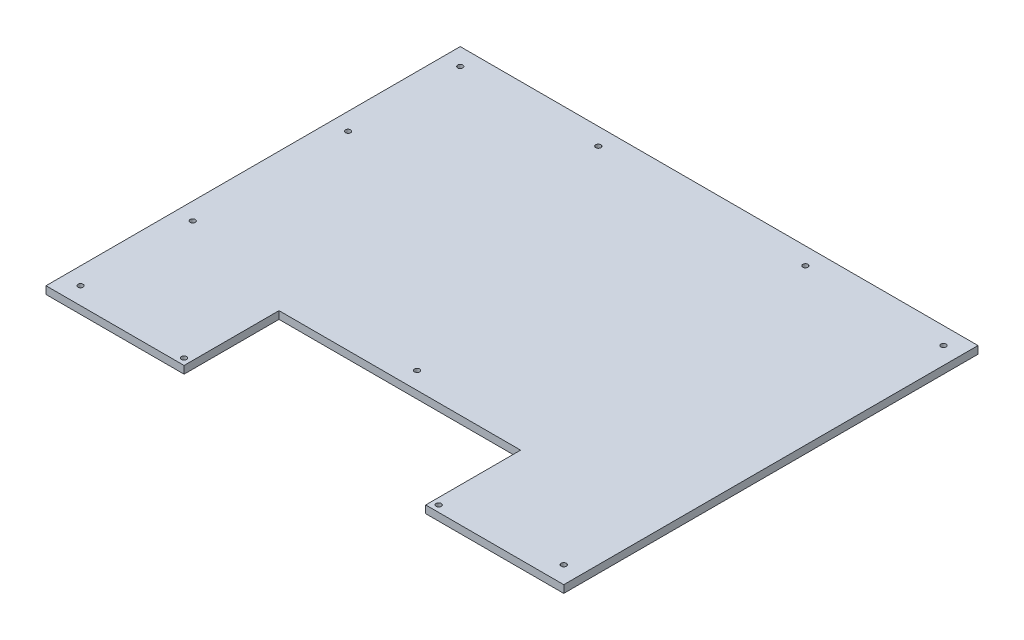
ISO-10303-21;
HEADER;
FILE_DESCRIPTION(('STEP AP214'),'2;1');
FILE_NAME('part.step','',(''),(''),'','','');
FILE_SCHEMA(('AUTOMOTIVE_DESIGN { 1 0 10303 214 1 1 1 1 }'));
ENDSEC;
DATA;
#1=APPLICATION_CONTEXT('core data for automotive mechanical design processes');
#2=APPLICATION_PROTOCOL_DEFINITION('international standard','automotive_design',2000,#1);
#3=PRODUCT_CONTEXT('',#1,'mechanical');
#4=PRODUCT('Part','Part','',(#3));
#5=PRODUCT_RELATED_PRODUCT_CATEGORY('part','',(#4));
#6=PRODUCT_DEFINITION_FORMATION('','',#4);
#7=PRODUCT_DEFINITION_CONTEXT('part definition',#1,'design');
#8=PRODUCT_DEFINITION('design','',#6,#7);
#9=PRODUCT_DEFINITION_SHAPE('','',#8);
#10=(LENGTH_UNIT() NAMED_UNIT(*) SI_UNIT(.MILLI.,.METRE.));
#11=(NAMED_UNIT(*) PLANE_ANGLE_UNIT() SI_UNIT($,.RADIAN.));
#12=(NAMED_UNIT(*) SI_UNIT($,.STERADIAN.) SOLID_ANGLE_UNIT());
#13=UNCERTAINTY_MEASURE_WITH_UNIT(LENGTH_MEASURE(1.E-05),#10,'distance_accuracy_value','');
#14=(GEOMETRIC_REPRESENTATION_CONTEXT(3) GLOBAL_UNCERTAINTY_ASSIGNED_CONTEXT((#13)) GLOBAL_UNIT_ASSIGNED_CONTEXT((#10,
#11,#12)) REPRESENTATION_CONTEXT('',''));
#15=CARTESIAN_POINT('',(0.,0.,0.));
#16=DIRECTION('',(0.,0.,1.));
#17=DIRECTION('',(1.,0.,0.));
#18=AXIS2_PLACEMENT_3D('',#15,#16,#17);
#19=CARTESIAN_POINT('',(190.5,5.588,152.4));
#20=DIRECTION('',(-1.,0.,0.));
#21=DIRECTION('',(0.,0.,1.));
#22=AXIS2_PLACEMENT_3D('',#19,#20,#21);
#23=PLANE('',#22);
#24=DIRECTION('',(0.,0.,-1.));
#25=VECTOR('',#24,1.);
#26=CARTESIAN_POINT('',(190.5,0.,152.4));
#27=LINE('',#26,#25);
#28=CARTESIAN_POINT('',(190.5,0.,152.4));
#29=VERTEX_POINT('',#28);
#30=CARTESIAN_POINT('',(190.5,0.,-152.4));
#31=VERTEX_POINT('',#30);
#32=EDGE_CURVE('E132',#29,#31,#27,.T.);
#33=ORIENTED_EDGE('',*,*,#32,.T.);
#34=DIRECTION('',(0.,-1.,0.));
#35=VECTOR('',#34,1.);
#36=CARTESIAN_POINT('',(190.5,5.588,-152.4));
#37=LINE('',#36,#35);
#38=CARTESIAN_POINT('',(190.5,5.588,-152.4));
#39=VERTEX_POINT('',#38);
#40=EDGE_CURVE('E11',#39,#31,#37,.T.);
#41=ORIENTED_EDGE('',*,*,#40,.F.);
#42=DIRECTION('',(0.,0.,-1.));
#43=VECTOR('',#42,1.);
#44=CARTESIAN_POINT('',(190.5,5.588,152.4));
#45=LINE('',#44,#43);
#46=CARTESIAN_POINT('',(190.5,5.588,152.4));
#47=VERTEX_POINT('',#46);
#48=EDGE_CURVE('E147',#47,#39,#45,.T.);
#49=ORIENTED_EDGE('',*,*,#48,.F.);
#50=DIRECTION('',(0.,-1.,0.));
#51=VECTOR('',#50,1.);
#52=CARTESIAN_POINT('',(190.5,5.588,152.4));
#53=LINE('',#52,#51);
#54=EDGE_CURVE('E128',#47,#29,#53,.T.);
#55=ORIENTED_EDGE('',*,*,#54,.T.);
#56=EDGE_LOOP('',(#33,#41,#49,#55));
#57=FACE_BOUND('',#56,.T.);
#58=ADVANCED_FACE('F36',(#57),#23,.F.);
#59=CARTESIAN_POINT('',(-190.5,5.588,-152.4));
#60=DIRECTION('',(0.,0.,1.));
#61=DIRECTION('',(1.,0.,0.));
#62=AXIS2_PLACEMENT_3D('',#59,#60,#61);
#63=PLANE('',#62);
#64=DIRECTION('',(-1.,0.,0.));
#65=VECTOR('',#64,1.);
#66=CARTESIAN_POINT('',(-190.5,0.,-152.4));
#67=LINE('',#66,#65);
#68=CARTESIAN_POINT('',(-190.5,0.,-152.4));
#69=VERTEX_POINT('',#68);
#70=EDGE_CURVE('E135',#31,#69,#67,.T.);
#71=ORIENTED_EDGE('',*,*,#70,.T.);
#72=DIRECTION('',(0.,-1.,0.));
#73=VECTOR('',#72,1.);
#74=CARTESIAN_POINT('',(-190.5,5.588,-152.4));
#75=LINE('',#74,#73);
#76=CARTESIAN_POINT('',(-190.5,5.588,-152.4));
#77=VERTEX_POINT('',#76);
#78=EDGE_CURVE('E44',#77,#69,#75,.T.);
#79=ORIENTED_EDGE('',*,*,#78,.F.);
#80=DIRECTION('',(-1.,0.,0.));
#81=VECTOR('',#80,1.);
#82=CARTESIAN_POINT('',(-190.5,5.588,-152.4));
#83=LINE('',#82,#81);
#84=EDGE_CURVE('E95',#39,#77,#83,.T.);
#85=ORIENTED_EDGE('',*,*,#84,.F.);
#86=ORIENTED_EDGE('',*,*,#40,.T.);
#87=EDGE_LOOP('',(#71,#79,#85,#86));
#88=FACE_BOUND('',#87,.T.);
#89=ADVANCED_FACE('F288',(#88),#63,.F.);
#90=CARTESIAN_POINT('',(-190.5,5.588,152.4));
#91=DIRECTION('',(1.,0.,0.));
#92=DIRECTION('',(0.,0.,-1.));
#93=AXIS2_PLACEMENT_3D('',#90,#91,#92);
#94=PLANE('',#93);
#95=DIRECTION('',(0.,0.,1.));
#96=VECTOR('',#95,1.);
#97=CARTESIAN_POINT('',(-190.5,0.,152.4));
#98=LINE('',#97,#96);
#99=CARTESIAN_POINT('',(-190.5,0.,152.4));
#100=VERTEX_POINT('',#99);
#101=EDGE_CURVE('E138',#69,#100,#98,.T.);
#102=ORIENTED_EDGE('',*,*,#101,.T.);
#103=DIRECTION('',(0.,-1.,0.));
#104=VECTOR('',#103,1.);
#105=CARTESIAN_POINT('',(-190.5,5.588,152.4));
#106=LINE('',#105,#104);
#107=CARTESIAN_POINT('',(-190.5,5.588,152.4));
#108=VERTEX_POINT('',#107);
#109=EDGE_CURVE('E154',#108,#100,#106,.T.);
#110=ORIENTED_EDGE('',*,*,#109,.F.);
#111=DIRECTION('',(0.,0.,1.));
#112=VECTOR('',#111,1.);
#113=CARTESIAN_POINT('',(-190.5,5.588,152.4));
#114=LINE('',#113,#112);
#115=EDGE_CURVE('E162',#77,#108,#114,.T.);
#116=ORIENTED_EDGE('',*,*,#115,.F.);
#117=ORIENTED_EDGE('',*,*,#78,.T.);
#118=EDGE_LOOP('',(#102,#110,#116,#117));
#119=FACE_BOUND('',#118,.T.);
#120=ADVANCED_FACE('F160',(#119),#94,.F.);
#121=CARTESIAN_POINT('',(-190.5,5.588,152.4));
#122=DIRECTION('',(0.,0.,-1.));
#123=DIRECTION('',(-1.,0.,0.));
#124=AXIS2_PLACEMENT_3D('',#121,#122,#123);
#125=PLANE('',#124);
#126=DIRECTION('',(1.,0.,0.));
#127=VECTOR('',#126,1.);
#128=CARTESIAN_POINT('',(-190.5,0.,152.4));
#129=LINE('',#128,#127);
#130=CARTESIAN_POINT('',(-88.8999999999999,0.,152.4));
#131=VERTEX_POINT('',#130);
#132=EDGE_CURVE('E140',#100,#131,#129,.T.);
#133=ORIENTED_EDGE('',*,*,#132,.T.);
#134=DIRECTION('',(0.,-1.,0.));
#135=VECTOR('',#134,1.);
#136=CARTESIAN_POINT('',(-88.8999999999999,5.588,152.4));
#137=LINE('',#136,#135);
#138=CARTESIAN_POINT('',(-88.8999999999999,5.588,152.4));
#139=VERTEX_POINT('',#138);
#140=EDGE_CURVE('E151',#139,#131,#137,.T.);
#141=ORIENTED_EDGE('',*,*,#140,.F.);
#142=DIRECTION('',(1.,0.,0.));
#143=VECTOR('',#142,1.);
#144=CARTESIAN_POINT('',(-190.5,5.588,152.4));
#145=LINE('',#144,#143);
#146=EDGE_CURVE('E174',#108,#139,#145,.T.);
#147=ORIENTED_EDGE('',*,*,#146,.F.);
#148=ORIENTED_EDGE('',*,*,#109,.T.);
#149=EDGE_LOOP('',(#133,#141,#147,#148));
#150=FACE_BOUND('',#149,.T.);
#151=ADVANCED_FACE('F170',(#150),#125,.F.);
#152=CARTESIAN_POINT('',(-88.8999999999999,5.588,152.4));
#153=DIRECTION('',(-1.,0.,0.));
#154=DIRECTION('',(0.,0.,1.));
#155=AXIS2_PLACEMENT_3D('',#152,#153,#154);
#156=PLANE('',#155);
#157=DIRECTION('',(0.,0.,-1.));
#158=VECTOR('',#157,1.);
#159=CARTESIAN_POINT('',(-88.8999999999999,0.,152.4));
#160=LINE('',#159,#158);
#161=CARTESIAN_POINT('',(-88.8999999999999,0.,82.55));
#162=VERTEX_POINT('',#161);
#163=EDGE_CURVE('E142',#131,#162,#160,.T.);
#164=ORIENTED_EDGE('',*,*,#163,.T.);
#165=DIRECTION('',(0.,-1.,0.));
#166=VECTOR('',#165,1.);
#167=CARTESIAN_POINT('',(-88.8999999999999,5.588,82.55));
#168=LINE('',#167,#166);
#169=CARTESIAN_POINT('',(-88.8999999999999,5.588,82.55));
#170=VERTEX_POINT('',#169);
#171=EDGE_CURVE('E123',#170,#162,#168,.T.);
#172=ORIENTED_EDGE('',*,*,#171,.F.);
#173=DIRECTION('',(0.,0.,-1.));
#174=VECTOR('',#173,1.);
#175=CARTESIAN_POINT('',(-88.8999999999999,5.588,152.4));
#176=LINE('',#175,#174);
#177=EDGE_CURVE('E114',#139,#170,#176,.T.);
#178=ORIENTED_EDGE('',*,*,#177,.F.);
#179=ORIENTED_EDGE('',*,*,#140,.T.);
#180=EDGE_LOOP('',(#164,#172,#178,#179));
#181=FACE_BOUND('',#180,.T.);
#182=ADVANCED_FACE('F173',(#181),#156,.F.);
#183=CARTESIAN_POINT('',(-88.8999999999999,5.588,82.55));
#184=DIRECTION('',(0.,0.,-1.));
#185=DIRECTION('',(-1.,0.,0.));
#186=AXIS2_PLACEMENT_3D('',#183,#184,#185);
#187=PLANE('',#186);
#188=DIRECTION('',(1.,0.,0.));
#189=VECTOR('',#188,1.);
#190=CARTESIAN_POINT('',(-88.8999999999999,0.,82.55));
#191=LINE('',#190,#189);
#192=CARTESIAN_POINT('',(88.9000000000001,0.,82.55));
#193=VERTEX_POINT('',#192);
#194=EDGE_CURVE('E122',#162,#193,#191,.T.);
#195=ORIENTED_EDGE('',*,*,#194,.T.);
#196=DIRECTION('',(0.,-1.,0.));
#197=VECTOR('',#196,1.);
#198=CARTESIAN_POINT('',(88.9000000000001,5.588,82.55));
#199=LINE('',#198,#197);
#200=CARTESIAN_POINT('',(88.9000000000001,5.588,82.55));
#201=VERTEX_POINT('',#200);
#202=EDGE_CURVE('E119',#201,#193,#199,.T.);
#203=ORIENTED_EDGE('',*,*,#202,.F.);
#204=DIRECTION('',(1.,0.,0.));
#205=VECTOR('',#204,1.);
#206=CARTESIAN_POINT('',(-88.8999999999999,5.588,82.55));
#207=LINE('',#206,#205);
#208=EDGE_CURVE('E108',#170,#201,#207,.T.);
#209=ORIENTED_EDGE('',*,*,#208,.F.);
#210=ORIENTED_EDGE('',*,*,#171,.T.);
#211=EDGE_LOOP('',(#195,#203,#209,#210));
#212=FACE_BOUND('',#211,.T.);
#213=ADVANCED_FACE('F120',(#212),#187,.F.);
#214=CARTESIAN_POINT('',(88.9000000000001,5.588,152.4));
#215=DIRECTION('',(1.,0.,0.));
#216=DIRECTION('',(0.,0.,-1.));
#217=AXIS2_PLACEMENT_3D('',#214,#215,#216);
#218=PLANE('',#217);
#219=DIRECTION('',(0.,0.,1.));
#220=VECTOR('',#219,1.);
#221=CARTESIAN_POINT('',(88.9000000000001,0.,152.4));
#222=LINE('',#221,#220);
#223=CARTESIAN_POINT('',(88.9000000000001,0.,152.4));
#224=VERTEX_POINT('',#223);
#225=EDGE_CURVE('E81',#193,#224,#222,.T.);
#226=ORIENTED_EDGE('',*,*,#225,.T.);
#227=DIRECTION('',(0.,-1.,0.));
#228=VECTOR('',#227,1.);
#229=CARTESIAN_POINT('',(88.9000000000001,5.588,152.4));
#230=LINE('',#229,#228);
#231=CARTESIAN_POINT('',(88.9000000000001,5.588,152.4));
#232=VERTEX_POINT('',#231);
#233=EDGE_CURVE('E124',#232,#224,#230,.T.);
#234=ORIENTED_EDGE('',*,*,#233,.F.);
#235=DIRECTION('',(0.,0.,1.));
#236=VECTOR('',#235,1.);
#237=CARTESIAN_POINT('',(88.9000000000001,5.588,152.4));
#238=LINE('',#237,#236);
#239=EDGE_CURVE('E112',#201,#232,#238,.T.);
#240=ORIENTED_EDGE('',*,*,#239,.F.);
#241=ORIENTED_EDGE('',*,*,#202,.T.);
#242=EDGE_LOOP('',(#226,#234,#240,#241));
#243=FACE_BOUND('',#242,.T.);
#244=ADVANCED_FACE('F126',(#243),#218,.F.);
#245=CARTESIAN_POINT('',(88.9000000000001,5.588,152.4));
#246=DIRECTION('',(0.,0.,-1.));
#247=DIRECTION('',(-1.,0.,0.));
#248=AXIS2_PLACEMENT_3D('',#245,#246,#247);
#249=PLANE('',#248);
#250=DIRECTION('',(1.,0.,0.));
#251=VECTOR('',#250,1.);
#252=CARTESIAN_POINT('',(88.9000000000001,0.,152.4));
#253=LINE('',#252,#251);
#254=EDGE_CURVE('E87',#224,#29,#253,.T.);
#255=ORIENTED_EDGE('',*,*,#254,.T.);
#256=ORIENTED_EDGE('',*,*,#54,.F.);
#257=DIRECTION('',(1.,0.,0.));
#258=VECTOR('',#257,1.);
#259=CARTESIAN_POINT('',(88.9000000000001,5.588,152.4));
#260=LINE('',#259,#258);
#261=EDGE_CURVE('E52',#232,#47,#260,.T.);
#262=ORIENTED_EDGE('',*,*,#261,.F.);
#263=ORIENTED_EDGE('',*,*,#233,.T.);
#264=EDGE_LOOP('',(#255,#256,#262,#263));
#265=FACE_BOUND('',#264,.T.);
#266=ADVANCED_FACE('F250',(#265),#249,.F.);
#267=CARTESIAN_POINT('',(0.,5.588,0.));
#268=DIRECTION('',(0.,-1.,0.));
#269=DIRECTION('',(0.,0.,-1.));
#270=AXIS2_PLACEMENT_3D('',#267,#268,#269);
#271=PLANE('',#270);
#272=CARTESIAN_POINT('',(-76.2,5.588,-139.7));
#273=DIRECTION('',(0.,1.,0.));
#274=DIRECTION('',(0.,0.,1.));
#275=AXIS2_PLACEMENT_3D('',#272,#273,#274);
#276=CIRCLE('',#275,1.89865);
#277=CARTESIAN_POINT('',(-76.2,5.588,-137.80135));
#278=VERTEX_POINT('',#277);
#279=EDGE_CURVE('E242',#278,#278,#276,.T.);
#280=ORIENTED_EDGE('',*,*,#279,.F.);
#281=EDGE_LOOP('',(#280));
#282=FACE_BOUND('',#281,.T.);
#283=CARTESIAN_POINT('',(76.2,5.588,-139.7));
#284=DIRECTION('',(0.,1.,0.));
#285=DIRECTION('',(0.,0.,1.));
#286=AXIS2_PLACEMENT_3D('',#283,#284,#285);
#287=CIRCLE('',#286,1.89865);
#288=CARTESIAN_POINT('',(76.2,5.588,-137.80135));
#289=VERTEX_POINT('',#288);
#290=EDGE_CURVE('E236',#289,#289,#287,.T.);
#291=ORIENTED_EDGE('',*,*,#290,.F.);
#292=EDGE_LOOP('',(#291));
#293=FACE_BOUND('',#292,.T.);
#294=CARTESIAN_POINT('',(1.04083408558608E-13,5.588,69.85));
#295=DIRECTION('',(0.,1.,0.));
#296=DIRECTION('',(0.,0.,1.));
#297=AXIS2_PLACEMENT_3D('',#294,#295,#296);
#298=CIRCLE('',#297,1.89865);
#299=CARTESIAN_POINT('',(1.04083408558608E-13,5.588,71.74865));
#300=VERTEX_POINT('',#299);
#301=EDGE_CURVE('E230',#300,#300,#298,.T.);
#302=ORIENTED_EDGE('',*,*,#301,.F.);
#303=EDGE_LOOP('',(#302));
#304=FACE_BOUND('',#303,.T.);
#305=CARTESIAN_POINT('',(-93.6751999999999,5.588,147.6248));
#306=DIRECTION('',(0.,1.,0.));
#307=DIRECTION('',(0.,0.,1.));
#308=AXIS2_PLACEMENT_3D('',#305,#306,#307);
#309=CIRCLE('',#308,1.89865);
#310=CARTESIAN_POINT('',(-93.6751999999999,5.588,149.52345));
#311=VERTEX_POINT('',#310);
#312=EDGE_CURVE('E224',#311,#311,#309,.T.);
#313=ORIENTED_EDGE('',*,*,#312,.F.);
#314=EDGE_LOOP('',(#313));
#315=FACE_BOUND('',#314,.T.);
#316=CARTESIAN_POINT('',(-177.8,5.588,139.7));
#317=DIRECTION('',(0.,1.,0.));
#318=DIRECTION('',(0.,0.,1.));
#319=AXIS2_PLACEMENT_3D('',#316,#317,#318);
#320=CIRCLE('',#319,1.89865);
#321=CARTESIAN_POINT('',(-177.8,5.588,141.59865));
#322=VERTEX_POINT('',#321);
#323=EDGE_CURVE('E218',#322,#322,#320,.T.);
#324=ORIENTED_EDGE('',*,*,#323,.F.);
#325=EDGE_LOOP('',(#324));
#326=FACE_BOUND('',#325,.T.);
#327=CARTESIAN_POINT('',(-177.8,5.588,-139.7));
#328=DIRECTION('',(0.,1.,0.));
#329=DIRECTION('',(0.,0.,1.));
#330=AXIS2_PLACEMENT_3D('',#327,#328,#329);
#331=CIRCLE('',#330,1.89865);
#332=CARTESIAN_POINT('',(-177.8,5.588,-137.80135));
#333=VERTEX_POINT('',#332);
#334=EDGE_CURVE('E212',#333,#333,#331,.T.);
#335=ORIENTED_EDGE('',*,*,#334,.F.);
#336=EDGE_LOOP('',(#335));
#337=FACE_BOUND('',#336,.T.);
#338=CARTESIAN_POINT('',(177.8,5.588,-139.7));
#339=DIRECTION('',(0.,1.,0.));
#340=DIRECTION('',(0.,0.,1.));
#341=AXIS2_PLACEMENT_3D('',#338,#339,#340);
#342=CIRCLE('',#341,1.89865);
#343=CARTESIAN_POINT('',(177.8,5.588,-137.80135));
#344=VERTEX_POINT('',#343);
#345=EDGE_CURVE('E206',#344,#344,#342,.T.);
#346=ORIENTED_EDGE('',*,*,#345,.F.);
#347=EDGE_LOOP('',(#346));
#348=FACE_BOUND('',#347,.T.);
#349=CARTESIAN_POINT('',(177.8,5.588,139.7));
#350=DIRECTION('',(0.,1.,0.));
#351=DIRECTION('',(0.,0.,1.));
#352=AXIS2_PLACEMENT_3D('',#349,#350,#351);
#353=CIRCLE('',#352,1.89865);
#354=CARTESIAN_POINT('',(177.8,5.588,141.59865));
#355=VERTEX_POINT('',#354);
#356=EDGE_CURVE('E200',#355,#355,#353,.T.);
#357=ORIENTED_EDGE('',*,*,#356,.F.);
#358=EDGE_LOOP('',(#357));
#359=FACE_BOUND('',#358,.T.);
#360=CARTESIAN_POINT('',(93.6752000000001,5.588,147.6248));
#361=DIRECTION('',(0.,1.,0.));
#362=DIRECTION('',(0.,0.,1.));
#363=AXIS2_PLACEMENT_3D('',#360,#361,#362);
#364=CIRCLE('',#363,1.89865);
#365=CARTESIAN_POINT('',(93.6752000000001,5.588,149.52345));
#366=VERTEX_POINT('',#365);
#367=EDGE_CURVE('E194',#366,#366,#364,.T.);
#368=ORIENTED_EDGE('',*,*,#367,.F.);
#369=EDGE_LOOP('',(#368));
#370=FACE_BOUND('',#369,.T.);
#371=CARTESIAN_POINT('',(-177.8,5.588,-57.15));
#372=DIRECTION('',(0.,1.,0.));
#373=DIRECTION('',(0.,0.,1.));
#374=AXIS2_PLACEMENT_3D('',#371,#372,#373);
#375=CIRCLE('',#374,1.89865);
#376=CARTESIAN_POINT('',(-177.8,5.588,-55.25135));
#377=VERTEX_POINT('',#376);
#378=EDGE_CURVE('E188',#377,#377,#375,.T.);
#379=ORIENTED_EDGE('',*,*,#378,.F.);
#380=EDGE_LOOP('',(#379));
#381=FACE_BOUND('',#380,.T.);
#382=CARTESIAN_POINT('',(-177.8,5.588,57.15));
#383=DIRECTION('',(0.,1.,0.));
#384=DIRECTION('',(0.,0.,1.));
#385=AXIS2_PLACEMENT_3D('',#382,#383,#384);
#386=CIRCLE('',#385,1.89865);
#387=CARTESIAN_POINT('',(-177.8,5.588,59.04865));
#388=VERTEX_POINT('',#387);
#389=EDGE_CURVE('E182',#388,#388,#386,.T.);
#390=ORIENTED_EDGE('',*,*,#389,.F.);
#391=EDGE_LOOP('',(#390));
#392=FACE_BOUND('',#391,.T.);
#393=ORIENTED_EDGE('',*,*,#48,.T.);
#394=ORIENTED_EDGE('',*,*,#84,.T.);
#395=ORIENTED_EDGE('',*,*,#115,.T.);
#396=ORIENTED_EDGE('',*,*,#146,.T.);
#397=ORIENTED_EDGE('',*,*,#177,.T.);
#398=ORIENTED_EDGE('',*,*,#208,.T.);
#399=ORIENTED_EDGE('',*,*,#239,.T.);
#400=ORIENTED_EDGE('',*,*,#261,.T.);
#401=EDGE_LOOP('',(#393,#394,#395,#396,#397,#398,#399,#400));
#402=FACE_BOUND('',#401,.T.);
#403=ADVANCED_FACE('F110',(#282,#293,#304,#315,#326,#337,#348,#359,#370,#381,#392,#402),#271,.F.);
#404=CARTESIAN_POINT('',(0.,0.,0.));
#405=DIRECTION('',(0.,-1.,0.));
#406=DIRECTION('',(0.,0.,-1.));
#407=AXIS2_PLACEMENT_3D('',#404,#405,#406);
#408=PLANE('',#407);
#409=CARTESIAN_POINT('',(-76.2,0.,-139.7));
#410=DIRECTION('',(0.,1.,0.));
#411=DIRECTION('',(0.,0.,1.));
#412=AXIS2_PLACEMENT_3D('',#409,#410,#411);
#413=CIRCLE('',#412,1.89865);
#414=CARTESIAN_POINT('',(-76.2,0.,-137.80135));
#415=VERTEX_POINT('',#414);
#416=EDGE_CURVE('E239',#415,#415,#413,.T.);
#417=ORIENTED_EDGE('',*,*,#416,.T.);
#418=EDGE_LOOP('',(#417));
#419=FACE_BOUND('',#418,.T.);
#420=CARTESIAN_POINT('',(76.2,0.,-139.7));
#421=DIRECTION('',(0.,1.,0.));
#422=DIRECTION('',(0.,0.,1.));
#423=AXIS2_PLACEMENT_3D('',#420,#421,#422);
#424=CIRCLE('',#423,1.89865);
#425=CARTESIAN_POINT('',(76.2,0.,-137.80135));
#426=VERTEX_POINT('',#425);
#427=EDGE_CURVE('E233',#426,#426,#424,.T.);
#428=ORIENTED_EDGE('',*,*,#427,.T.);
#429=EDGE_LOOP('',(#428));
#430=FACE_BOUND('',#429,.T.);
#431=CARTESIAN_POINT('',(1.04083408558608E-13,0.,69.85));
#432=DIRECTION('',(0.,1.,0.));
#433=DIRECTION('',(0.,0.,1.));
#434=AXIS2_PLACEMENT_3D('',#431,#432,#433);
#435=CIRCLE('',#434,1.89865);
#436=CARTESIAN_POINT('',(1.04083408558608E-13,0.,71.74865));
#437=VERTEX_POINT('',#436);
#438=EDGE_CURVE('E227',#437,#437,#435,.T.);
#439=ORIENTED_EDGE('',*,*,#438,.T.);
#440=EDGE_LOOP('',(#439));
#441=FACE_BOUND('',#440,.T.);
#442=CARTESIAN_POINT('',(-93.6751999999999,0.,147.6248));
#443=DIRECTION('',(0.,1.,0.));
#444=DIRECTION('',(0.,0.,1.));
#445=AXIS2_PLACEMENT_3D('',#442,#443,#444);
#446=CIRCLE('',#445,1.89865);
#447=CARTESIAN_POINT('',(-93.6751999999999,0.,149.52345));
#448=VERTEX_POINT('',#447);
#449=EDGE_CURVE('E221',#448,#448,#446,.T.);
#450=ORIENTED_EDGE('',*,*,#449,.T.);
#451=EDGE_LOOP('',(#450));
#452=FACE_BOUND('',#451,.T.);
#453=CARTESIAN_POINT('',(-177.8,0.,139.7));
#454=DIRECTION('',(0.,1.,0.));
#455=DIRECTION('',(0.,0.,1.));
#456=AXIS2_PLACEMENT_3D('',#453,#454,#455);
#457=CIRCLE('',#456,1.89865);
#458=CARTESIAN_POINT('',(-177.8,0.,141.59865));
#459=VERTEX_POINT('',#458);
#460=EDGE_CURVE('E215',#459,#459,#457,.T.);
#461=ORIENTED_EDGE('',*,*,#460,.T.);
#462=EDGE_LOOP('',(#461));
#463=FACE_BOUND('',#462,.T.);
#464=CARTESIAN_POINT('',(-177.8,0.,-139.7));
#465=DIRECTION('',(0.,1.,0.));
#466=DIRECTION('',(0.,0.,1.));
#467=AXIS2_PLACEMENT_3D('',#464,#465,#466);
#468=CIRCLE('',#467,1.89865);
#469=CARTESIAN_POINT('',(-177.8,0.,-137.80135));
#470=VERTEX_POINT('',#469);
#471=EDGE_CURVE('E209',#470,#470,#468,.T.);
#472=ORIENTED_EDGE('',*,*,#471,.T.);
#473=EDGE_LOOP('',(#472));
#474=FACE_BOUND('',#473,.T.);
#475=CARTESIAN_POINT('',(177.8,0.,-139.7));
#476=DIRECTION('',(0.,1.,0.));
#477=DIRECTION('',(0.,0.,1.));
#478=AXIS2_PLACEMENT_3D('',#475,#476,#477);
#479=CIRCLE('',#478,1.89865);
#480=CARTESIAN_POINT('',(177.8,0.,-137.80135));
#481=VERTEX_POINT('',#480);
#482=EDGE_CURVE('E203',#481,#481,#479,.T.);
#483=ORIENTED_EDGE('',*,*,#482,.T.);
#484=EDGE_LOOP('',(#483));
#485=FACE_BOUND('',#484,.T.);
#486=CARTESIAN_POINT('',(177.8,0.,139.7));
#487=DIRECTION('',(0.,1.,0.));
#488=DIRECTION('',(0.,0.,1.));
#489=AXIS2_PLACEMENT_3D('',#486,#487,#488);
#490=CIRCLE('',#489,1.89865);
#491=CARTESIAN_POINT('',(177.8,0.,141.59865));
#492=VERTEX_POINT('',#491);
#493=EDGE_CURVE('E197',#492,#492,#490,.T.);
#494=ORIENTED_EDGE('',*,*,#493,.T.);
#495=EDGE_LOOP('',(#494));
#496=FACE_BOUND('',#495,.T.);
#497=CARTESIAN_POINT('',(93.6752000000001,0.,147.6248));
#498=DIRECTION('',(0.,1.,0.));
#499=DIRECTION('',(0.,0.,1.));
#500=AXIS2_PLACEMENT_3D('',#497,#498,#499);
#501=CIRCLE('',#500,1.89865);
#502=CARTESIAN_POINT('',(93.6752000000001,0.,149.52345));
#503=VERTEX_POINT('',#502);
#504=EDGE_CURVE('E191',#503,#503,#501,.T.);
#505=ORIENTED_EDGE('',*,*,#504,.T.);
#506=EDGE_LOOP('',(#505));
#507=FACE_BOUND('',#506,.T.);
#508=CARTESIAN_POINT('',(-177.8,0.,-57.15));
#509=DIRECTION('',(0.,1.,0.));
#510=DIRECTION('',(0.,0.,1.));
#511=AXIS2_PLACEMENT_3D('',#508,#509,#510);
#512=CIRCLE('',#511,1.89865);
#513=CARTESIAN_POINT('',(-177.8,0.,-55.25135));
#514=VERTEX_POINT('',#513);
#515=EDGE_CURVE('E185',#514,#514,#512,.T.);
#516=ORIENTED_EDGE('',*,*,#515,.T.);
#517=EDGE_LOOP('',(#516));
#518=FACE_BOUND('',#517,.T.);
#519=CARTESIAN_POINT('',(-177.8,0.,57.15));
#520=DIRECTION('',(0.,1.,0.));
#521=DIRECTION('',(0.,0.,1.));
#522=AXIS2_PLACEMENT_3D('',#519,#520,#521);
#523=CIRCLE('',#522,1.89865);
#524=CARTESIAN_POINT('',(-177.8,0.,59.04865));
#525=VERTEX_POINT('',#524);
#526=EDGE_CURVE('E136',#525,#525,#523,.T.);
#527=ORIENTED_EDGE('',*,*,#526,.T.);
#528=EDGE_LOOP('',(#527));
#529=FACE_BOUND('',#528,.T.);
#530=ORIENTED_EDGE('',*,*,#32,.F.);
#531=ORIENTED_EDGE('',*,*,#254,.F.);
#532=ORIENTED_EDGE('',*,*,#225,.F.);
#533=ORIENTED_EDGE('',*,*,#194,.F.);
#534=ORIENTED_EDGE('',*,*,#163,.F.);
#535=ORIENTED_EDGE('',*,*,#132,.F.);
#536=ORIENTED_EDGE('',*,*,#101,.F.);
#537=ORIENTED_EDGE('',*,*,#70,.F.);
#538=EDGE_LOOP('',(#530,#531,#532,#533,#534,#535,#536,#537));
#539=FACE_BOUND('',#538,.T.);
#540=ADVANCED_FACE('F166',(#419,#430,#441,#452,#463,#474,#485,#496,#507,#518,#529,#539),#408,.T.);
#541=CARTESIAN_POINT('',(-177.8,5.588,57.15));
#542=DIRECTION('',(0.,1.,0.));
#543=DIRECTION('',(0.,0.,1.));
#544=AXIS2_PLACEMENT_3D('',#541,#542,#543);
#545=CYLINDRICAL_SURFACE('',#544,1.89865);
#546=ORIENTED_EDGE('',*,*,#526,.F.);
#547=EDGE_LOOP('',(#546));
#548=FACE_BOUND('',#547,.T.);
#549=ORIENTED_EDGE('',*,*,#389,.T.);
#550=EDGE_LOOP('',(#549));
#551=FACE_BOUND('',#550,.T.);
#552=ADVANCED_FACE('F272',(#548,#551),#545,.F.);
#553=CARTESIAN_POINT('',(-177.8,5.588,-57.15));
#554=DIRECTION('',(0.,1.,0.));
#555=DIRECTION('',(0.,0.,1.));
#556=AXIS2_PLACEMENT_3D('',#553,#554,#555);
#557=CYLINDRICAL_SURFACE('',#556,1.89865);
#558=ORIENTED_EDGE('',*,*,#515,.F.);
#559=EDGE_LOOP('',(#558));
#560=FACE_BOUND('',#559,.T.);
#561=ORIENTED_EDGE('',*,*,#378,.T.);
#562=EDGE_LOOP('',(#561));
#563=FACE_BOUND('',#562,.T.);
#564=ADVANCED_FACE('F274',(#560,#563),#557,.F.);
#565=CARTESIAN_POINT('',(93.6752000000001,5.588,147.6248));
#566=DIRECTION('',(0.,1.,0.));
#567=DIRECTION('',(0.,0.,1.));
#568=AXIS2_PLACEMENT_3D('',#565,#566,#567);
#569=CYLINDRICAL_SURFACE('',#568,1.89865);
#570=ORIENTED_EDGE('',*,*,#504,.F.);
#571=EDGE_LOOP('',(#570));
#572=FACE_BOUND('',#571,.T.);
#573=ORIENTED_EDGE('',*,*,#367,.T.);
#574=EDGE_LOOP('',(#573));
#575=FACE_BOUND('',#574,.T.);
#576=ADVANCED_FACE('F281',(#572,#575),#569,.F.);
#577=CARTESIAN_POINT('',(177.8,5.588,139.7));
#578=DIRECTION('',(0.,1.,0.));
#579=DIRECTION('',(0.,0.,1.));
#580=AXIS2_PLACEMENT_3D('',#577,#578,#579);
#581=CYLINDRICAL_SURFACE('',#580,1.89865);
#582=ORIENTED_EDGE('',*,*,#493,.F.);
#583=EDGE_LOOP('',(#582));
#584=FACE_BOUND('',#583,.T.);
#585=ORIENTED_EDGE('',*,*,#356,.T.);
#586=EDGE_LOOP('',(#585));
#587=FACE_BOUND('',#586,.T.);
#588=ADVANCED_FACE('F364',(#584,#587),#581,.F.);
#589=CARTESIAN_POINT('',(177.8,5.588,-139.7));
#590=DIRECTION('',(0.,1.,0.));
#591=DIRECTION('',(0.,0.,1.));
#592=AXIS2_PLACEMENT_3D('',#589,#590,#591);
#593=CYLINDRICAL_SURFACE('',#592,1.89865);
#594=ORIENTED_EDGE('',*,*,#482,.F.);
#595=EDGE_LOOP('',(#594));
#596=FACE_BOUND('',#595,.T.);
#597=ORIENTED_EDGE('',*,*,#345,.T.);
#598=EDGE_LOOP('',(#597));
#599=FACE_BOUND('',#598,.T.);
#600=ADVANCED_FACE('F374',(#596,#599),#593,.F.);
#601=CARTESIAN_POINT('',(-177.8,5.588,-139.7));
#602=DIRECTION('',(0.,1.,0.));
#603=DIRECTION('',(0.,0.,1.));
#604=AXIS2_PLACEMENT_3D('',#601,#602,#603);
#605=CYLINDRICAL_SURFACE('',#604,1.89865);
#606=ORIENTED_EDGE('',*,*,#471,.F.);
#607=EDGE_LOOP('',(#606));
#608=FACE_BOUND('',#607,.T.);
#609=ORIENTED_EDGE('',*,*,#334,.T.);
#610=EDGE_LOOP('',(#609));
#611=FACE_BOUND('',#610,.T.);
#612=ADVANCED_FACE('F384',(#608,#611),#605,.F.);
#613=CARTESIAN_POINT('',(-177.8,5.588,139.7));
#614=DIRECTION('',(0.,1.,0.));
#615=DIRECTION('',(0.,0.,1.));
#616=AXIS2_PLACEMENT_3D('',#613,#614,#615);
#617=CYLINDRICAL_SURFACE('',#616,1.89865);
#618=ORIENTED_EDGE('',*,*,#460,.F.);
#619=EDGE_LOOP('',(#618));
#620=FACE_BOUND('',#619,.T.);
#621=ORIENTED_EDGE('',*,*,#323,.T.);
#622=EDGE_LOOP('',(#621));
#623=FACE_BOUND('',#622,.T.);
#624=ADVANCED_FACE('F394',(#620,#623),#617,.F.);
#625=CARTESIAN_POINT('',(-93.6751999999999,5.588,147.6248));
#626=DIRECTION('',(0.,1.,0.));
#627=DIRECTION('',(0.,0.,1.));
#628=AXIS2_PLACEMENT_3D('',#625,#626,#627);
#629=CYLINDRICAL_SURFACE('',#628,1.89865);
#630=ORIENTED_EDGE('',*,*,#449,.F.);
#631=EDGE_LOOP('',(#630));
#632=FACE_BOUND('',#631,.T.);
#633=ORIENTED_EDGE('',*,*,#312,.T.);
#634=EDGE_LOOP('',(#633));
#635=FACE_BOUND('',#634,.T.);
#636=ADVANCED_FACE('F404',(#632,#635),#629,.F.);
#637=CARTESIAN_POINT('',(1.04083408558608E-13,5.588,69.85));
#638=DIRECTION('',(0.,1.,0.));
#639=DIRECTION('',(0.,0.,1.));
#640=AXIS2_PLACEMENT_3D('',#637,#638,#639);
#641=CYLINDRICAL_SURFACE('',#640,1.89865);
#642=ORIENTED_EDGE('',*,*,#438,.F.);
#643=EDGE_LOOP('',(#642));
#644=FACE_BOUND('',#643,.T.);
#645=ORIENTED_EDGE('',*,*,#301,.T.);
#646=EDGE_LOOP('',(#645));
#647=FACE_BOUND('',#646,.T.);
#648=ADVANCED_FACE('F414',(#644,#647),#641,.F.);
#649=CARTESIAN_POINT('',(76.2,5.588,-139.7));
#650=DIRECTION('',(0.,1.,0.));
#651=DIRECTION('',(0.,0.,1.));
#652=AXIS2_PLACEMENT_3D('',#649,#650,#651);
#653=CYLINDRICAL_SURFACE('',#652,1.89865);
#654=ORIENTED_EDGE('',*,*,#427,.F.);
#655=EDGE_LOOP('',(#654));
#656=FACE_BOUND('',#655,.T.);
#657=ORIENTED_EDGE('',*,*,#290,.T.);
#658=EDGE_LOOP('',(#657));
#659=FACE_BOUND('',#658,.T.);
#660=ADVANCED_FACE('F424',(#656,#659),#653,.F.);
#661=CARTESIAN_POINT('',(-76.2,5.588,-139.7));
#662=DIRECTION('',(0.,1.,0.));
#663=DIRECTION('',(0.,0.,1.));
#664=AXIS2_PLACEMENT_3D('',#661,#662,#663);
#665=CYLINDRICAL_SURFACE('',#664,1.89865);
#666=ORIENTED_EDGE('',*,*,#416,.F.);
#667=EDGE_LOOP('',(#666));
#668=FACE_BOUND('',#667,.T.);
#669=ORIENTED_EDGE('',*,*,#279,.T.);
#670=EDGE_LOOP('',(#669));
#671=FACE_BOUND('',#670,.T.);
#672=ADVANCED_FACE('F246',(#668,#671),#665,.F.);
#673=CLOSED_SHELL('',(#58,#89,#120,#151,#182,#213,#244,#266,#403,#540,#552,#564,#576,#588,#600,
#612,#624,#636,#648,#660,#672));
#674=MANIFOLD_SOLID_BREP('B2',#673);
#675=ADVANCED_BREP_SHAPE_REPRESENTATION('',(#18,#674),#14);
#676=SHAPE_DEFINITION_REPRESENTATION(#9,#675);
ENDSEC;
END-ISO-10303-21;
